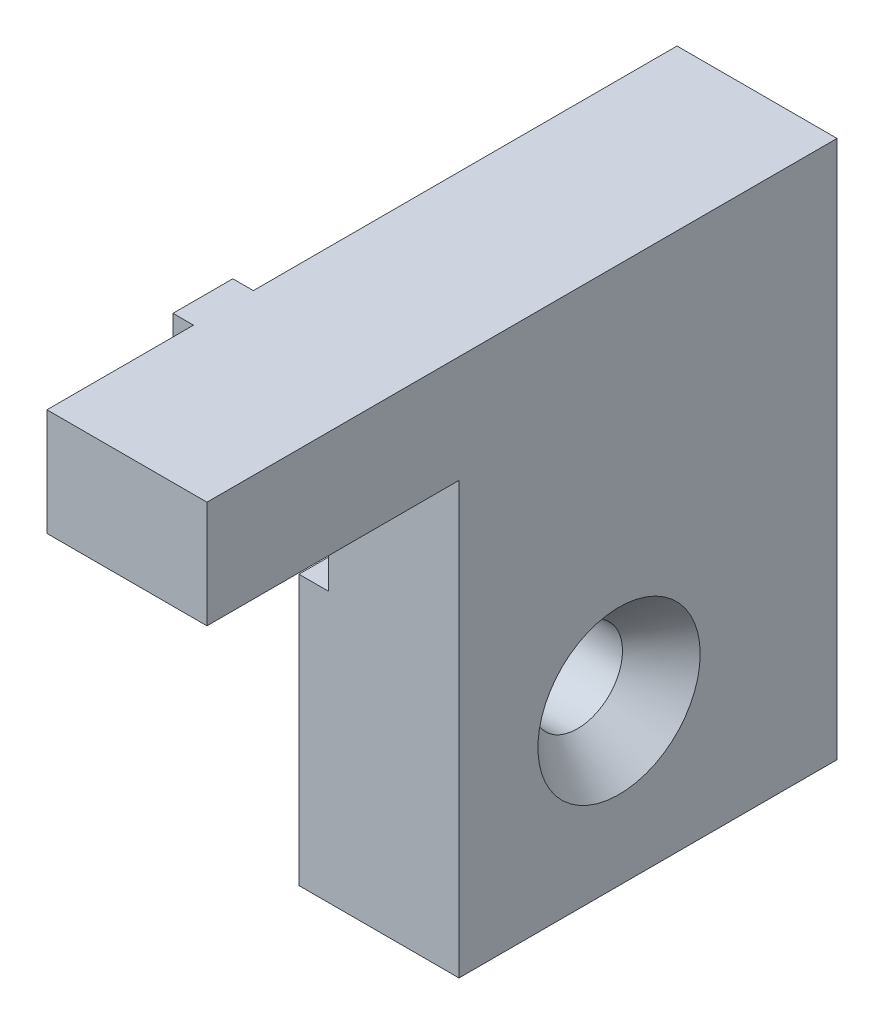
ISO-10303-21;
HEADER;
FILE_DESCRIPTION(('STEP AP214'),'2;1');
FILE_NAME('part.step','',(''),(''),'','','');
FILE_SCHEMA(('AUTOMOTIVE_DESIGN { 1 0 10303 214 1 1 1 1 }'));
ENDSEC;
DATA;
#1=APPLICATION_CONTEXT('core data for automotive mechanical design processes');
#2=APPLICATION_PROTOCOL_DEFINITION('international standard','automotive_design',2000,#1);
#3=PRODUCT_CONTEXT('',#1,'mechanical');
#4=PRODUCT('Part','Part','',(#3));
#5=PRODUCT_RELATED_PRODUCT_CATEGORY('part','',(#4));
#6=PRODUCT_DEFINITION_FORMATION('','',#4);
#7=PRODUCT_DEFINITION_CONTEXT('part definition',#1,'design');
#8=PRODUCT_DEFINITION('design','',#6,#7);
#9=PRODUCT_DEFINITION_SHAPE('','',#8);
#10=(LENGTH_UNIT() NAMED_UNIT(*) SI_UNIT(.MILLI.,.METRE.));
#11=(NAMED_UNIT(*) PLANE_ANGLE_UNIT() SI_UNIT($,.RADIAN.));
#12=(NAMED_UNIT(*) SI_UNIT($,.STERADIAN.) SOLID_ANGLE_UNIT());
#13=UNCERTAINTY_MEASURE_WITH_UNIT(LENGTH_MEASURE(1.E-05),#10,'distance_accuracy_value','');
#14=(GEOMETRIC_REPRESENTATION_CONTEXT(3) GLOBAL_UNCERTAINTY_ASSIGNED_CONTEXT((#13)) GLOBAL_UNIT_ASSIGNED_CONTEXT((#10,
#11,#12)) REPRESENTATION_CONTEXT('',''));
#15=CARTESIAN_POINT('',(0.,0.,0.));
#16=DIRECTION('',(0.,0.,1.));
#17=DIRECTION('',(1.,0.,0.));
#18=AXIS2_PLACEMENT_3D('',#15,#16,#17);
#19=CARTESIAN_POINT('',(0.,0.,0.));
#20=DIRECTION('',(1.,0.,0.));
#21=DIRECTION('',(0.,0.,-1.));
#22=AXIS2_PLACEMENT_3D('',#19,#20,#21);
#23=PLANE('',#22);
#24=DIRECTION('',(0.,1.,0.));
#25=VECTOR('',#24,1.);
#26=CARTESIAN_POINT('',(0.,8.50000000000002,8.36999999999999));
#27=LINE('',#26,#25);
#28=CARTESIAN_POINT('',(0.,0.,8.36999999999999));
#29=VERTEX_POINT('',#28);
#30=CARTESIAN_POINT('',(0.,8.5,8.36999999999999));
#31=VERTEX_POINT('',#30);
#32=EDGE_CURVE('E157',#29,#31,#27,.T.);
#33=ORIENTED_EDGE('',*,*,#32,.F.);
#34=DIRECTION('',(0.,0.,-1.));
#35=VECTOR('',#34,1.);
#36=CARTESIAN_POINT('',(0.,0.,0.));
#37=LINE('',#36,#35);
#38=CARTESIAN_POINT('',(0.,0.,20.));
#39=VERTEX_POINT('',#38);
#40=EDGE_CURVE('E202',#39,#29,#37,.T.);
#41=ORIENTED_EDGE('',*,*,#40,.F.);
#42=DIRECTION('',(0.,-1.,0.));
#43=VECTOR('',#42,1.);
#44=CARTESIAN_POINT('',(0.,0.,20.));
#45=LINE('',#44,#43);
#46=CARTESIAN_POINT('',(0.,8.49999999999999,20.));
#47=VERTEX_POINT('',#46);
#48=EDGE_CURVE('E227',#47,#39,#45,.T.);
#49=ORIENTED_EDGE('',*,*,#48,.F.);
#50=DIRECTION('',(0.,0.,1.));
#51=VECTOR('',#50,1.);
#52=CARTESIAN_POINT('',(0.,8.50000000000001,0.));
#53=LINE('',#52,#51);
#54=EDGE_CURVE('E57',#31,#47,#53,.T.);
#55=ORIENTED_EDGE('',*,*,#54,.F.);
#56=EDGE_LOOP('',(#33,#41,#49,#55));
#57=FACE_BOUND('',#56,.T.);
#58=ADVANCED_FACE('F42',(#57),#23,.F.);
#59=CARTESIAN_POINT('',(0.,-21.5,-12.7));
#60=DIRECTION('',(1.,0.,0.));
#61=DIRECTION('',(0.,0.,-1.));
#62=AXIS2_PLACEMENT_3D('',#59,#60,#61);
#63=CIRCLE('',#62,3.57124);
#64=CARTESIAN_POINT('',(0.,-21.5,-16.27124));
#65=VERTEX_POINT('',#64);
#66=EDGE_CURVE('E194',#65,#65,#63,.T.);
#67=ORIENTED_EDGE('',*,*,#66,.T.);
#68=EDGE_LOOP('',(#67));
#69=FACE_BOUND('',#68,.T.);
#70=DIRECTION('',(0.,-1.,0.));
#71=VECTOR('',#70,1.);
#72=CARTESIAN_POINT('',(0.,8.50000000000002,3.61999999999999));
#73=LINE('',#72,#71);
#74=CARTESIAN_POINT('',(0.,8.50000000000001,3.61999999999999));
#75=VERTEX_POINT('',#74);
#76=CARTESIAN_POINT('',(0.,0.,3.61999999999999));
#77=VERTEX_POINT('',#76);
#78=EDGE_CURVE('E65',#75,#77,#73,.T.);
#79=ORIENTED_EDGE('',*,*,#78,.F.);
#80=CARTESIAN_POINT('',(0.,8.50000000000002,-30.));
#81=VERTEX_POINT('',#80);
#82=EDGE_CURVE('E225',#81,#75,#53,.T.);
#83=ORIENTED_EDGE('',*,*,#82,.F.);
#84=DIRECTION('',(0.,1.,0.));
#85=VECTOR('',#84,1.);
#86=CARTESIAN_POINT('',(0.,0.,-30.));
#87=LINE('',#86,#85);
#88=CARTESIAN_POINT('',(0.,-34.2,-30.));
#89=VERTEX_POINT('',#88);
#90=EDGE_CURVE('E222',#89,#81,#87,.T.);
#91=ORIENTED_EDGE('',*,*,#90,.F.);
#92=DIRECTION('',(0.,0.,1.));
#93=VECTOR('',#92,1.);
#94=CARTESIAN_POINT('',(0.,-34.2,0.));
#95=LINE('',#94,#93);
#96=CARTESIAN_POINT('',(0.,-34.2,0.));
#97=VERTEX_POINT('',#96);
#98=EDGE_CURVE('E219',#89,#97,#95,.T.);
#99=ORIENTED_EDGE('',*,*,#98,.T.);
#100=DIRECTION('',(0.,1.,0.));
#101=VECTOR('',#100,1.);
#102=CARTESIAN_POINT('',(0.,0.,0.));
#103=LINE('',#102,#101);
#104=CARTESIAN_POINT('',(0.,-12.8,0.));
#105=VERTEX_POINT('',#104);
#106=EDGE_CURVE('E197',#97,#105,#103,.T.);
#107=ORIENTED_EDGE('',*,*,#106,.T.);
#108=DIRECTION('',(0.,0.,1.));
#109=VECTOR('',#108,1.);
#110=CARTESIAN_POINT('',(0.,-12.8,0.));
#111=LINE('',#110,#109);
#112=CARTESIAN_POINT('',(0.,-12.8,-8.));
#113=VERTEX_POINT('',#112);
#114=EDGE_CURVE('E161',#113,#105,#111,.T.);
#115=ORIENTED_EDGE('',*,*,#114,.F.);
#116=DIRECTION('',(0.,-1.,0.));
#117=VECTOR('',#116,1.);
#118=CARTESIAN_POINT('',(0.,0.,-8.));
#119=LINE('',#118,#117);
#120=CARTESIAN_POINT('',(0.,0.,-8.));
#121=VERTEX_POINT('',#120);
#122=EDGE_CURVE('E158',#121,#113,#119,.T.);
#123=ORIENTED_EDGE('',*,*,#122,.F.);
#124=EDGE_CURVE('E230',#77,#121,#37,.T.);
#125=ORIENTED_EDGE('',*,*,#124,.F.);
#126=EDGE_LOOP('',(#79,#83,#91,#99,#107,#115,#123,#125));
#127=FACE_BOUND('',#126,.T.);
#128=ADVANCED_FACE('F251',(#69,#127),#23,.F.);
#129=CARTESIAN_POINT('',(12.7,0.,0.));
#130=DIRECTION('',(0.,0.,1.));
#131=DIRECTION('',(1.,0.,0.));
#132=AXIS2_PLACEMENT_3D('',#129,#130,#131);
#133=PLANE('',#132);
#134=DIRECTION('',(-1.,0.,0.));
#135=VECTOR('',#134,1.);
#136=CARTESIAN_POINT('',(2.35,-12.8,0.));
#137=LINE('',#136,#135);
#138=CARTESIAN_POINT('',(2.35,-12.8,0.));
#139=VERTEX_POINT('',#138);
#140=EDGE_CURVE('E181',#139,#105,#137,.T.);
#141=ORIENTED_EDGE('',*,*,#140,.T.);
#142=ORIENTED_EDGE('',*,*,#106,.F.);
#143=DIRECTION('',(-1.,0.,0.));
#144=VECTOR('',#143,1.);
#145=CARTESIAN_POINT('',(12.7,-34.2,0.));
#146=LINE('',#145,#144);
#147=CARTESIAN_POINT('',(12.7,-34.2,0.));
#148=VERTEX_POINT('',#147);
#149=EDGE_CURVE('E11',#148,#97,#146,.T.);
#150=ORIENTED_EDGE('',*,*,#149,.F.);
#151=DIRECTION('',(0.,1.,0.));
#152=VECTOR('',#151,1.);
#153=CARTESIAN_POINT('',(12.7,0.,0.));
#154=LINE('',#153,#152);
#155=CARTESIAN_POINT('',(12.7,0.,0.));
#156=VERTEX_POINT('',#155);
#157=EDGE_CURVE('E198',#148,#156,#154,.T.);
#158=ORIENTED_EDGE('',*,*,#157,.T.);
#159=DIRECTION('',(-1.,0.,0.));
#160=VECTOR('',#159,1.);
#161=CARTESIAN_POINT('',(12.7,0.,0.));
#162=LINE('',#161,#160);
#163=CARTESIAN_POINT('',(2.35,0.,0.));
#164=VERTEX_POINT('',#163);
#165=EDGE_CURVE('E216',#156,#164,#162,.T.);
#166=ORIENTED_EDGE('',*,*,#165,.T.);
#167=DIRECTION('',(0.,1.,0.));
#168=VECTOR('',#167,1.);
#169=CARTESIAN_POINT('',(2.35,0.,0.));
#170=LINE('',#169,#168);
#171=EDGE_CURVE('E167',#139,#164,#170,.T.);
#172=ORIENTED_EDGE('',*,*,#171,.F.);
#173=EDGE_LOOP('',(#141,#142,#150,#158,#166,#172));
#174=FACE_BOUND('',#173,.T.);
#175=ADVANCED_FACE('F44',(#174),#133,.T.);
#176=CARTESIAN_POINT('',(12.7,-34.2,0.));
#177=DIRECTION('',(0.,-1.,0.));
#178=DIRECTION('',(0.,0.,-1.));
#179=AXIS2_PLACEMENT_3D('',#176,#177,#178);
#180=PLANE('',#179);
#181=ORIENTED_EDGE('',*,*,#98,.F.);
#182=DIRECTION('',(-1.,0.,0.));
#183=VECTOR('',#182,1.);
#184=CARTESIAN_POINT('',(12.7,-34.2,-30.));
#185=LINE('',#184,#183);
#186=CARTESIAN_POINT('',(12.7,-34.2,-30.));
#187=VERTEX_POINT('',#186);
#188=EDGE_CURVE('E50',#187,#89,#185,.T.);
#189=ORIENTED_EDGE('',*,*,#188,.F.);
#190=DIRECTION('',(0.,0.,1.));
#191=VECTOR('',#190,1.);
#192=CARTESIAN_POINT('',(12.7,-34.2,0.));
#193=LINE('',#192,#191);
#194=EDGE_CURVE('E201',#187,#148,#193,.T.);
#195=ORIENTED_EDGE('',*,*,#194,.T.);
#196=ORIENTED_EDGE('',*,*,#149,.T.);
#197=EDGE_LOOP('',(#181,#189,#195,#196));
#198=FACE_BOUND('',#197,.T.);
#199=ADVANCED_FACE('F252',(#198),#180,.T.);
#200=CARTESIAN_POINT('',(12.7,0.,-30.));
#201=DIRECTION('',(0.,0.,1.));
#202=DIRECTION('',(1.,0.,0.));
#203=AXIS2_PLACEMENT_3D('',#200,#201,#202);
#204=PLANE('',#203);
#205=ORIENTED_EDGE('',*,*,#90,.T.);
#206=DIRECTION('',(-1.,0.,0.));
#207=VECTOR('',#206,1.);
#208=CARTESIAN_POINT('',(12.7,8.50000000000002,-30.));
#209=LINE('',#208,#207);
#210=CARTESIAN_POINT('',(12.7,8.50000000000002,-30.));
#211=VERTEX_POINT('',#210);
#212=EDGE_CURVE('E241',#211,#81,#209,.T.);
#213=ORIENTED_EDGE('',*,*,#212,.F.);
#214=DIRECTION('',(0.,1.,0.));
#215=VECTOR('',#214,1.);
#216=CARTESIAN_POINT('',(12.7,0.,-30.));
#217=LINE('',#216,#215);
#218=EDGE_CURVE('E205',#187,#211,#217,.T.);
#219=ORIENTED_EDGE('',*,*,#218,.F.);
#220=ORIENTED_EDGE('',*,*,#188,.T.);
#221=EDGE_LOOP('',(#205,#213,#219,#220));
#222=FACE_BOUND('',#221,.T.);
#223=ADVANCED_FACE('F246',(#222),#204,.F.);
#224=CARTESIAN_POINT('',(12.7,8.50000000000001,0.));
#225=DIRECTION('',(0.,-1.,0.));
#226=DIRECTION('',(0.,0.,-1.));
#227=AXIS2_PLACEMENT_3D('',#224,#225,#226);
#228=PLANE('',#227);
#229=ORIENTED_EDGE('',*,*,#82,.T.);
#230=DIRECTION('',(1.,0.,0.));
#231=VECTOR('',#230,1.);
#232=CARTESIAN_POINT('',(-1.63,8.50000000000002,3.61999999999999));
#233=LINE('',#232,#231);
#234=CARTESIAN_POINT('',(-1.63,8.50000000000002,3.61999999999999));
#235=VERTEX_POINT('',#234);
#236=EDGE_CURVE('E142',#235,#75,#233,.T.);
#237=ORIENTED_EDGE('',*,*,#236,.F.);
#238=DIRECTION('',(0.,0.,-1.));
#239=VECTOR('',#238,1.);
#240=CARTESIAN_POINT('',(-1.63,8.50000000000002,8.36999999999999));
#241=LINE('',#240,#239);
#242=CARTESIAN_POINT('',(-1.63,8.50000000000002,8.36999999999999));
#243=VERTEX_POINT('',#242);
#244=EDGE_CURVE('E135',#243,#235,#241,.T.);
#245=ORIENTED_EDGE('',*,*,#244,.F.);
#246=DIRECTION('',(1.,0.,0.));
#247=VECTOR('',#246,1.);
#248=CARTESIAN_POINT('',(-1.63,8.50000000000002,8.36999999999999));
#249=LINE('',#248,#247);
#250=EDGE_CURVE('E139',#243,#31,#249,.T.);
#251=ORIENTED_EDGE('',*,*,#250,.T.);
#252=ORIENTED_EDGE('',*,*,#54,.T.);
#253=DIRECTION('',(-1.,0.,0.));
#254=VECTOR('',#253,1.);
#255=CARTESIAN_POINT('',(12.7,8.49999999999999,20.));
#256=LINE('',#255,#254);
#257=CARTESIAN_POINT('',(12.7,8.49999999999999,20.));
#258=VERTEX_POINT('',#257);
#259=EDGE_CURVE('E238',#258,#47,#256,.T.);
#260=ORIENTED_EDGE('',*,*,#259,.F.);
#261=DIRECTION('',(0.,0.,1.));
#262=VECTOR('',#261,1.);
#263=CARTESIAN_POINT('',(12.7,8.50000000000001,0.));
#264=LINE('',#263,#262);
#265=EDGE_CURVE('E208',#211,#258,#264,.T.);
#266=ORIENTED_EDGE('',*,*,#265,.F.);
#267=ORIENTED_EDGE('',*,*,#212,.T.);
#268=EDGE_LOOP('',(#229,#237,#245,#251,#252,#260,#266,#267));
#269=FACE_BOUND('',#268,.T.);
#270=ADVANCED_FACE('F137',(#269),#228,.F.);
#271=CARTESIAN_POINT('',(12.7,0.,20.));
#272=DIRECTION('',(0.,0.,-1.));
#273=DIRECTION('',(-1.,0.,0.));
#274=AXIS2_PLACEMENT_3D('',#271,#272,#273);
#275=PLANE('',#274);
#276=ORIENTED_EDGE('',*,*,#48,.T.);
#277=DIRECTION('',(-1.,0.,0.));
#278=VECTOR('',#277,1.);
#279=CARTESIAN_POINT('',(12.7,0.,20.));
#280=LINE('',#279,#278);
#281=CARTESIAN_POINT('',(12.7,0.,20.));
#282=VERTEX_POINT('',#281);
#283=EDGE_CURVE('E235',#282,#39,#280,.T.);
#284=ORIENTED_EDGE('',*,*,#283,.F.);
#285=DIRECTION('',(0.,-1.,0.));
#286=VECTOR('',#285,1.);
#287=CARTESIAN_POINT('',(12.7,0.,20.));
#288=LINE('',#287,#286);
#289=EDGE_CURVE('E211',#258,#282,#288,.T.);
#290=ORIENTED_EDGE('',*,*,#289,.F.);
#291=ORIENTED_EDGE('',*,*,#259,.T.);
#292=EDGE_LOOP('',(#276,#284,#290,#291));
#293=FACE_BOUND('',#292,.T.);
#294=ADVANCED_FACE('F281',(#293),#275,.F.);
#295=CARTESIAN_POINT('',(12.7,0.,0.));
#296=DIRECTION('',(0.,1.,0.));
#297=DIRECTION('',(0.,0.,1.));
#298=AXIS2_PLACEMENT_3D('',#295,#296,#297);
#299=PLANE('',#298);
#300=ORIENTED_EDGE('',*,*,#40,.T.);
#301=DIRECTION('',(1.,0.,0.));
#302=VECTOR('',#301,1.);
#303=CARTESIAN_POINT('',(-1.63,0.,8.36999999999999));
#304=LINE('',#303,#302);
#305=CARTESIAN_POINT('',(-1.63,0.,8.36999999999999));
#306=VERTEX_POINT('',#305);
#307=EDGE_CURVE('E276',#306,#29,#304,.T.);
#308=ORIENTED_EDGE('',*,*,#307,.F.);
#309=DIRECTION('',(0.,0.,1.));
#310=VECTOR('',#309,1.);
#311=CARTESIAN_POINT('',(-1.63,0.,8.36999999999999));
#312=LINE('',#311,#310);
#313=CARTESIAN_POINT('',(-1.63,0.,3.61999999999999));
#314=VERTEX_POINT('',#313);
#315=EDGE_CURVE('E151',#314,#306,#312,.T.);
#316=ORIENTED_EDGE('',*,*,#315,.F.);
#317=DIRECTION('',(1.,0.,0.));
#318=VECTOR('',#317,1.);
#319=CARTESIAN_POINT('',(-1.63,0.,3.61999999999999));
#320=LINE('',#319,#318);
#321=EDGE_CURVE('E163',#314,#77,#320,.T.);
#322=ORIENTED_EDGE('',*,*,#321,.T.);
#323=ORIENTED_EDGE('',*,*,#124,.T.);
#324=DIRECTION('',(-1.,0.,0.));
#325=VECTOR('',#324,1.);
#326=CARTESIAN_POINT('',(2.35,0.,-8.));
#327=LINE('',#326,#325);
#328=CARTESIAN_POINT('',(2.35,0.,-8.));
#329=VERTEX_POINT('',#328);
#330=EDGE_CURVE('E178',#329,#121,#327,.T.);
#331=ORIENTED_EDGE('',*,*,#330,.F.);
#332=DIRECTION('',(0.,0.,-1.));
#333=VECTOR('',#332,1.);
#334=CARTESIAN_POINT('',(2.35,0.,0.));
#335=LINE('',#334,#333);
#336=EDGE_CURVE('E170',#164,#329,#335,.T.);
#337=ORIENTED_EDGE('',*,*,#336,.F.);
#338=ORIENTED_EDGE('',*,*,#165,.F.);
#339=DIRECTION('',(0.,0.,-1.));
#340=VECTOR('',#339,1.);
#341=CARTESIAN_POINT('',(12.7,0.,0.));
#342=LINE('',#341,#340);
#343=EDGE_CURVE('E214',#282,#156,#342,.T.);
#344=ORIENTED_EDGE('',*,*,#343,.F.);
#345=ORIENTED_EDGE('',*,*,#283,.T.);
#346=EDGE_LOOP('',(#300,#308,#316,#322,#323,#331,#337,#338,#344,#345));
#347=FACE_BOUND('',#346,.T.);
#348=ADVANCED_FACE('F266',(#347),#299,.F.);
#349=CARTESIAN_POINT('',(12.7,0.,0.));
#350=DIRECTION('',(1.,0.,0.));
#351=DIRECTION('',(0.,0.,-1.));
#352=AXIS2_PLACEMENT_3D('',#349,#350,#351);
#353=PLANE('',#352);
#354=CARTESIAN_POINT('',(12.7,-21.5,-12.7));
#355=DIRECTION('',(1.,0.,0.));
#356=DIRECTION('',(0.,0.,-1.));
#357=AXIS2_PLACEMENT_3D('',#354,#355,#356);
#358=CIRCLE('',#357,6.4389);
#359=CARTESIAN_POINT('',(12.7,-21.5,-19.1389));
#360=VERTEX_POINT('',#359);
#361=EDGE_CURVE('E184',#360,#360,#358,.T.);
#362=ORIENTED_EDGE('',*,*,#361,.F.);
#363=EDGE_LOOP('',(#362));
#364=FACE_BOUND('',#363,.T.);
#365=ORIENTED_EDGE('',*,*,#157,.F.);
#366=ORIENTED_EDGE('',*,*,#194,.F.);
#367=ORIENTED_EDGE('',*,*,#218,.T.);
#368=ORIENTED_EDGE('',*,*,#265,.T.);
#369=ORIENTED_EDGE('',*,*,#289,.T.);
#370=ORIENTED_EDGE('',*,*,#343,.T.);
#371=EDGE_LOOP('',(#365,#366,#367,#368,#369,#370));
#372=FACE_BOUND('',#371,.T.);
#373=ADVANCED_FACE('F283',(#364,#372),#353,.T.);
#374=CARTESIAN_POINT('',(12.7,-21.5,-12.7));
#375=DIRECTION('',(1.,0.,0.));
#376=DIRECTION('',(0.,0.,-1.));
#377=AXIS2_PLACEMENT_3D('',#374,#375,#376);
#378=CYLINDRICAL_SURFACE('',#377,3.57124);
#379=ORIENTED_EDGE('',*,*,#66,.F.);
#380=EDGE_LOOP('',(#379));
#381=FACE_BOUND('',#380,.T.);
#382=CARTESIAN_POINT('',(9.40113453334859,-21.5,-12.7));
#383=DIRECTION('',(1.,0.,0.));
#384=DIRECTION('',(0.,0.,-1.));
#385=AXIS2_PLACEMENT_3D('',#382,#383,#384);
#386=CIRCLE('',#385,3.57124);
#387=CARTESIAN_POINT('',(9.40113453334859,-21.5,-16.27124));
#388=VERTEX_POINT('',#387);
#389=EDGE_CURVE('E191',#388,#388,#386,.T.);
#390=ORIENTED_EDGE('',*,*,#389,.T.);
#391=EDGE_LOOP('',(#390));
#392=FACE_BOUND('',#391,.T.);
#393=ADVANCED_FACE('F373',(#381,#392),#378,.F.);
#394=CARTESIAN_POINT('',(12.7,-21.5,-12.7));
#395=DIRECTION('',(1.,0.,0.));
#396=DIRECTION('',(0.,0.,-1.));
#397=AXIS2_PLACEMENT_3D('',#394,#395,#396);
#398=CONICAL_SURFACE('',#397,6.4389,0.715584993317674);
#399=ORIENTED_EDGE('',*,*,#389,.F.);
#400=EDGE_LOOP('',(#399));
#401=FACE_BOUND('',#400,.T.);
#402=ORIENTED_EDGE('',*,*,#361,.T.);
#403=EDGE_LOOP('',(#402));
#404=FACE_BOUND('',#403,.T.);
#405=ADVANCED_FACE('F380',(#401,#404),#398,.F.);
#406=CARTESIAN_POINT('',(2.35,-12.8,0.));
#407=DIRECTION('',(0.,-1.,0.));
#408=DIRECTION('',(0.,0.,-1.));
#409=AXIS2_PLACEMENT_3D('',#406,#407,#408);
#410=PLANE('',#409);
#411=ORIENTED_EDGE('',*,*,#114,.T.);
#412=ORIENTED_EDGE('',*,*,#140,.F.);
#413=DIRECTION('',(0.,0.,1.));
#414=VECTOR('',#413,1.);
#415=CARTESIAN_POINT('',(2.35,-12.8,0.));
#416=LINE('',#415,#414);
#417=CARTESIAN_POINT('',(2.35,-12.8,-8.));
#418=VERTEX_POINT('',#417);
#419=EDGE_CURVE('E176',#418,#139,#416,.T.);
#420=ORIENTED_EDGE('',*,*,#419,.F.);
#421=DIRECTION('',(-1.,0.,0.));
#422=VECTOR('',#421,1.);
#423=CARTESIAN_POINT('',(2.35,-12.8,-8.));
#424=LINE('',#423,#422);
#425=EDGE_CURVE('E185',#418,#113,#424,.T.);
#426=ORIENTED_EDGE('',*,*,#425,.T.);
#427=EDGE_LOOP('',(#411,#412,#420,#426));
#428=FACE_BOUND('',#427,.T.);
#429=ADVANCED_FACE('F260',(#428),#410,.F.);
#430=CARTESIAN_POINT('',(2.35,0.,-8.));
#431=DIRECTION('',(0.,0.,-1.));
#432=DIRECTION('',(0.,1.,0.));
#433=AXIS2_PLACEMENT_3D('',#430,#431,#432);
#434=PLANE('',#433);
#435=ORIENTED_EDGE('',*,*,#122,.T.);
#436=ORIENTED_EDGE('',*,*,#425,.F.);
#437=DIRECTION('',(0.,-1.,0.));
#438=VECTOR('',#437,1.);
#439=CARTESIAN_POINT('',(2.35,0.,-8.));
#440=LINE('',#439,#438);
#441=EDGE_CURVE('E173',#329,#418,#440,.T.);
#442=ORIENTED_EDGE('',*,*,#441,.F.);
#443=ORIENTED_EDGE('',*,*,#330,.T.);
#444=EDGE_LOOP('',(#435,#436,#442,#443));
#445=FACE_BOUND('',#444,.T.);
#446=ADVANCED_FACE('F264',(#445),#434,.F.);
#447=CARTESIAN_POINT('',(2.35,0.,0.));
#448=DIRECTION('',(1.,0.,0.));
#449=DIRECTION('',(0.,0.,-1.));
#450=AXIS2_PLACEMENT_3D('',#447,#448,#449);
#451=PLANE('',#450);
#452=ORIENTED_EDGE('',*,*,#171,.T.);
#453=ORIENTED_EDGE('',*,*,#336,.T.);
#454=ORIENTED_EDGE('',*,*,#441,.T.);
#455=ORIENTED_EDGE('',*,*,#419,.T.);
#456=EDGE_LOOP('',(#452,#453,#454,#455));
#457=FACE_BOUND('',#456,.T.);
#458=ADVANCED_FACE('F285',(#457),#451,.F.);
#459=CARTESIAN_POINT('',(-1.63,8.50000000000002,8.36999999999999));
#460=DIRECTION('',(0.,0.,-1.));
#461=DIRECTION('',(-1.,0.,0.));
#462=AXIS2_PLACEMENT_3D('',#459,#460,#461);
#463=PLANE('',#462);
#464=ORIENTED_EDGE('',*,*,#32,.T.);
#465=ORIENTED_EDGE('',*,*,#250,.F.);
#466=DIRECTION('',(0.,1.,0.));
#467=VECTOR('',#466,1.);
#468=CARTESIAN_POINT('',(-1.63,8.50000000000002,8.36999999999999));
#469=LINE('',#468,#467);
#470=EDGE_CURVE('E146',#306,#243,#469,.T.);
#471=ORIENTED_EDGE('',*,*,#470,.F.);
#472=ORIENTED_EDGE('',*,*,#307,.T.);
#473=EDGE_LOOP('',(#464,#465,#471,#472));
#474=FACE_BOUND('',#473,.T.);
#475=ADVANCED_FACE('F156',(#474),#463,.F.);
#476=CARTESIAN_POINT('',(-1.63,8.50000000000002,3.61999999999999));
#477=DIRECTION('',(0.,0.,1.));
#478=DIRECTION('',(0.,-1.,0.));
#479=AXIS2_PLACEMENT_3D('',#476,#477,#478);
#480=PLANE('',#479);
#481=ORIENTED_EDGE('',*,*,#78,.T.);
#482=ORIENTED_EDGE('',*,*,#321,.F.);
#483=DIRECTION('',(0.,-1.,0.));
#484=VECTOR('',#483,1.);
#485=CARTESIAN_POINT('',(-1.63,8.50000000000002,3.61999999999999));
#486=LINE('',#485,#484);
#487=EDGE_CURVE('E145',#235,#314,#486,.T.);
#488=ORIENTED_EDGE('',*,*,#487,.F.);
#489=ORIENTED_EDGE('',*,*,#236,.T.);
#490=EDGE_LOOP('',(#481,#482,#488,#489));
#491=FACE_BOUND('',#490,.T.);
#492=ADVANCED_FACE('F271',(#491),#480,.F.);
#493=CARTESIAN_POINT('',(-1.63,0.,0.));
#494=DIRECTION('',(1.,0.,0.));
#495=DIRECTION('',(0.,0.,-1.));
#496=AXIS2_PLACEMENT_3D('',#493,#494,#495);
#497=PLANE('',#496);
#498=ORIENTED_EDGE('',*,*,#470,.T.);
#499=ORIENTED_EDGE('',*,*,#244,.T.);
#500=ORIENTED_EDGE('',*,*,#487,.T.);
#501=ORIENTED_EDGE('',*,*,#315,.T.);
#502=EDGE_LOOP('',(#498,#499,#500,#501));
#503=FACE_BOUND('',#502,.T.);
#504=ADVANCED_FACE('F149',(#503),#497,.F.);
#505=CLOSED_SHELL('',(#58,#128,#175,#199,#223,#270,#294,#348,#373,#393,#405,#429,#446,#458,#475,
#492,#504));
#506=MANIFOLD_SOLID_BREP('B2',#505);
#507=ADVANCED_BREP_SHAPE_REPRESENTATION('',(#18,#506),#14);
#508=SHAPE_DEFINITION_REPRESENTATION(#9,#507);
ENDSEC;
END-ISO-10303-21;
